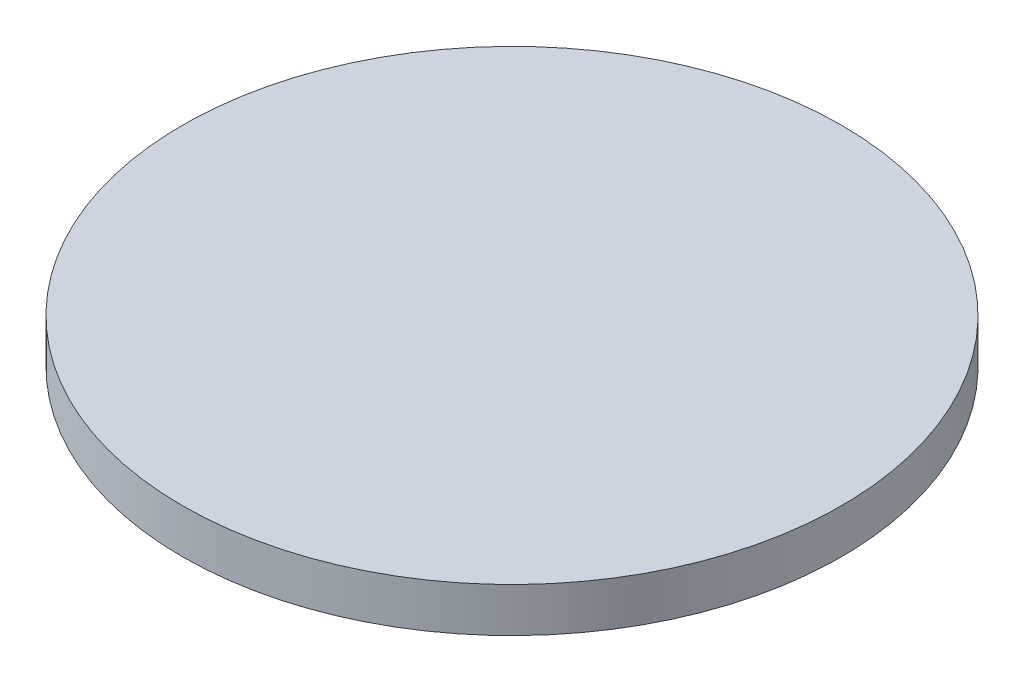
ISO-10303-21;
HEADER;
FILE_DESCRIPTION(('STEP AP214'),'2;1');
FILE_NAME('part.step','',(''),(''),'','','');
FILE_SCHEMA(('AUTOMOTIVE_DESIGN { 1 0 10303 214 1 1 1 1 }'));
ENDSEC;
DATA;
#1=APPLICATION_CONTEXT('core data for automotive mechanical design processes');
#2=APPLICATION_PROTOCOL_DEFINITION('international standard','automotive_design',2000,#1);
#3=PRODUCT_CONTEXT('',#1,'mechanical');
#4=PRODUCT('Part','Part','',(#3));
#5=PRODUCT_RELATED_PRODUCT_CATEGORY('part','',(#4));
#6=PRODUCT_DEFINITION_FORMATION('','',#4);
#7=PRODUCT_DEFINITION_CONTEXT('part definition',#1,'design');
#8=PRODUCT_DEFINITION('design','',#6,#7);
#9=PRODUCT_DEFINITION_SHAPE('','',#8);
#10=(LENGTH_UNIT() NAMED_UNIT(*) SI_UNIT(.MILLI.,.METRE.));
#11=(NAMED_UNIT(*) PLANE_ANGLE_UNIT() SI_UNIT($,.RADIAN.));
#12=(NAMED_UNIT(*) SI_UNIT($,.STERADIAN.) SOLID_ANGLE_UNIT());
#13=UNCERTAINTY_MEASURE_WITH_UNIT(LENGTH_MEASURE(1.E-05),#10,'distance_accuracy_value','');
#14=(GEOMETRIC_REPRESENTATION_CONTEXT(3) GLOBAL_UNCERTAINTY_ASSIGNED_CONTEXT((#13)) GLOBAL_UNIT_ASSIGNED_CONTEXT((#10,
#11,#12)) REPRESENTATION_CONTEXT('',''));
#15=CARTESIAN_POINT('',(0.,0.,0.));
#16=DIRECTION('',(0.,0.,1.));
#17=DIRECTION('',(1.,0.,0.));
#18=AXIS2_PLACEMENT_3D('',#15,#16,#17);
#19=CARTESIAN_POINT('',(0.,4.7,0.));
#20=DIRECTION('',(0.,-1.,0.));
#21=DIRECTION('',(0.,0.,-1.));
#22=AXIS2_PLACEMENT_3D('',#19,#20,#21);
#23=CYLINDRICAL_SURFACE('',#22,35.);
#24=CARTESIAN_POINT('',(0.,4.7,0.));
#25=DIRECTION('',(0.,1.,0.));
#26=DIRECTION('',(0.,0.,1.));
#27=AXIS2_PLACEMENT_3D('',#24,#25,#26);
#28=CIRCLE('',#27,35.);
#29=CARTESIAN_POINT('',(0.,4.7,35.0000000000001));
#30=VERTEX_POINT('',#29);
#31=EDGE_CURVE('E10',#30,#30,#28,.T.);
#32=ORIENTED_EDGE('',*,*,#31,.F.);
#33=EDGE_LOOP('',(#32));
#34=FACE_BOUND('',#33,.T.);
#35=CARTESIAN_POINT('',(0.,0.,0.));
#36=DIRECTION('',(0.,1.,0.));
#37=DIRECTION('',(0.,0.,1.));
#38=AXIS2_PLACEMENT_3D('',#35,#36,#37);
#39=CIRCLE('',#38,35.);
#40=CARTESIAN_POINT('',(0.,0.,35.0000000000001));
#41=VERTEX_POINT('',#40);
#42=EDGE_CURVE('E30',#41,#41,#39,.T.);
#43=ORIENTED_EDGE('',*,*,#42,.T.);
#44=EDGE_LOOP('',(#43));
#45=FACE_BOUND('',#44,.T.);
#46=ADVANCED_FACE('F27',(#34,#45),#23,.T.);
#47=CARTESIAN_POINT('',(0.,4.7,0.));
#48=DIRECTION('',(0.,1.,0.));
#49=DIRECTION('',(0.,0.,1.));
#50=AXIS2_PLACEMENT_3D('',#47,#48,#49);
#51=PLANE('',#50);
#52=ORIENTED_EDGE('',*,*,#31,.T.);
#53=EDGE_LOOP('',(#52));
#54=FACE_BOUND('',#53,.T.);
#55=ADVANCED_FACE('F42',(#54),#51,.T.);
#56=CARTESIAN_POINT('',(0.,0.,0.));
#57=DIRECTION('',(0.,1.,0.));
#58=DIRECTION('',(0.,0.,1.));
#59=AXIS2_PLACEMENT_3D('',#56,#57,#58);
#60=PLANE('',#59);
#61=ORIENTED_EDGE('',*,*,#42,.F.);
#62=EDGE_LOOP('',(#61));
#63=FACE_BOUND('',#62,.T.);
#64=ADVANCED_FACE('F40',(#63),#60,.F.);
#65=CLOSED_SHELL('',(#46,#55,#64));
#66=MANIFOLD_SOLID_BREP('B2',#65);
#67=ADVANCED_BREP_SHAPE_REPRESENTATION('',(#18,#66),#14);
#68=SHAPE_DEFINITION_REPRESENTATION(#9,#67);
ENDSEC;
END-ISO-10303-21;
